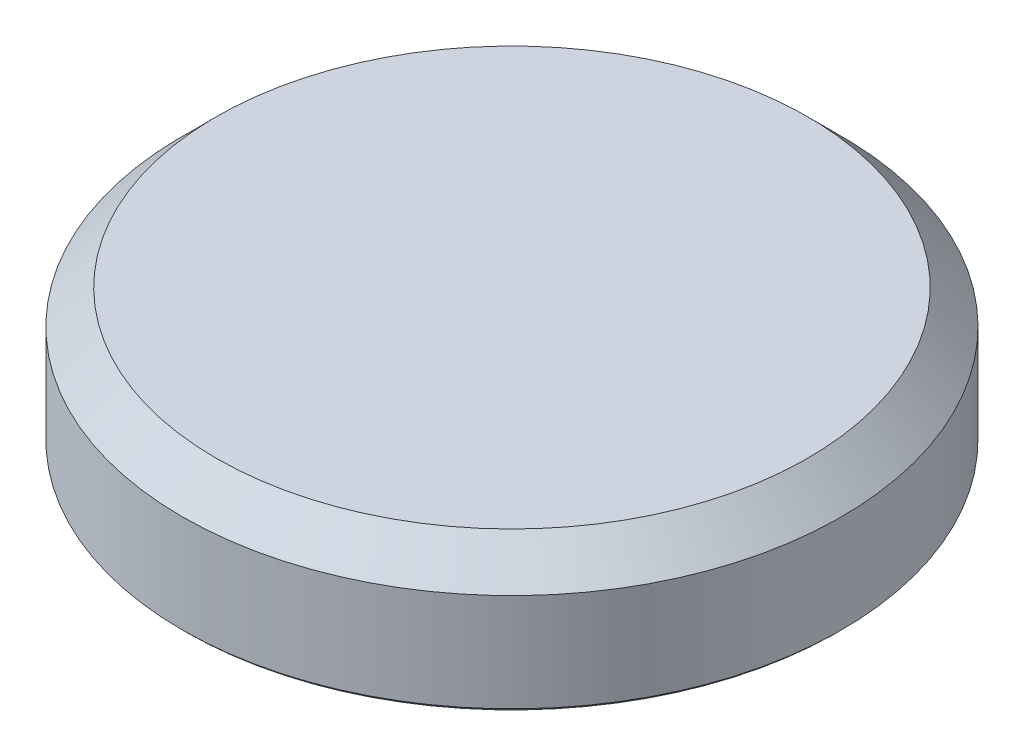
ISO-10303-21;
HEADER;
FILE_DESCRIPTION(('STEP AP214'),'2;1');
FILE_NAME('part.step','',(''),(''),'','','');
FILE_SCHEMA(('AUTOMOTIVE_DESIGN { 1 0 10303 214 1 1 1 1 }'));
ENDSEC;
DATA;
#1=APPLICATION_CONTEXT('core data for automotive mechanical design processes');
#2=APPLICATION_PROTOCOL_DEFINITION('international standard','automotive_design',2000,#1);
#3=PRODUCT_CONTEXT('',#1,'mechanical');
#4=PRODUCT('Part','Part','',(#3));
#5=PRODUCT_RELATED_PRODUCT_CATEGORY('part','',(#4));
#6=PRODUCT_DEFINITION_FORMATION('','',#4);
#7=PRODUCT_DEFINITION_CONTEXT('part definition',#1,'design');
#8=PRODUCT_DEFINITION('design','',#6,#7);
#9=PRODUCT_DEFINITION_SHAPE('','',#8);
#10=(LENGTH_UNIT() NAMED_UNIT(*) SI_UNIT(.MILLI.,.METRE.));
#11=(NAMED_UNIT(*) PLANE_ANGLE_UNIT() SI_UNIT($,.RADIAN.));
#12=(NAMED_UNIT(*) SI_UNIT($,.STERADIAN.) SOLID_ANGLE_UNIT());
#13=UNCERTAINTY_MEASURE_WITH_UNIT(LENGTH_MEASURE(1.E-05),#10,'distance_accuracy_value','');
#14=(GEOMETRIC_REPRESENTATION_CONTEXT(3) GLOBAL_UNCERTAINTY_ASSIGNED_CONTEXT((#13)) GLOBAL_UNIT_ASSIGNED_CONTEXT((#10,
#11,#12)) REPRESENTATION_CONTEXT('',''));
#15=CARTESIAN_POINT('',(0.,0.,0.));
#16=DIRECTION('',(0.,0.,1.));
#17=DIRECTION('',(1.,0.,0.));
#18=AXIS2_PLACEMENT_3D('',#15,#16,#17);
#19=CARTESIAN_POINT('',(0.,10.16,0.));
#20=DIRECTION('',(0.,-1.,0.));
#21=DIRECTION('',(0.,0.,-1.));
#22=AXIS2_PLACEMENT_3D('',#19,#20,#21);
#23=CYLINDRICAL_SURFACE('',#22,24.765);
#24=CARTESIAN_POINT('',(0.,0.254000000000004,0.));
#25=DIRECTION('',(0.,1.,0.));
#26=DIRECTION('',(0.,0.,1.));
#27=AXIS2_PLACEMENT_3D('',#24,#25,#26);
#28=CIRCLE('',#27,24.765);
#29=CARTESIAN_POINT('',(0.,0.254000000000004,24.765));
#30=VERTEX_POINT('',#29);
#31=EDGE_CURVE('E53',#30,#30,#28,.T.);
#32=ORIENTED_EDGE('',*,*,#31,.T.);
#33=EDGE_LOOP('',(#32));
#34=FACE_BOUND('',#33,.T.);
#35=CARTESIAN_POINT('',(0.,7.62,0.));
#36=DIRECTION('',(0.,1.,0.));
#37=DIRECTION('',(0.,0.,1.));
#38=AXIS2_PLACEMENT_3D('',#35,#36,#37);
#39=CIRCLE('',#38,24.765);
#40=CARTESIAN_POINT('',(0.,7.62,24.765));
#41=VERTEX_POINT('',#40);
#42=EDGE_CURVE('E111',#41,#41,#39,.F.);
#43=ORIENTED_EDGE('',*,*,#42,.T.);
#44=EDGE_LOOP('',(#43));
#45=FACE_BOUND('',#44,.T.);
#46=ADVANCED_FACE('F44',(#34,#45),#23,.T.);
#47=CARTESIAN_POINT('',(0.,10.16,0.));
#48=DIRECTION('',(0.,1.,0.));
#49=DIRECTION('',(0.,0.,1.));
#50=AXIS2_PLACEMENT_3D('',#47,#48,#49);
#51=PLANE('',#50);
#52=CARTESIAN_POINT('',(0.,10.16,0.));
#53=DIRECTION('',(0.,1.,0.));
#54=DIRECTION('',(0.,0.,1.));
#55=AXIS2_PLACEMENT_3D('',#52,#53,#54);
#56=CIRCLE('',#55,22.225);
#57=CARTESIAN_POINT('',(0.,10.16,22.225));
#58=VERTEX_POINT('',#57);
#59=EDGE_CURVE('E108',#58,#58,#56,.T.);
#60=ORIENTED_EDGE('',*,*,#59,.T.);
#61=EDGE_LOOP('',(#60));
#62=FACE_BOUND('',#61,.T.);
#63=ADVANCED_FACE('F132',(#62),#51,.T.);
#64=CARTESIAN_POINT('',(0.,0.,0.));
#65=DIRECTION('',(0.,1.,0.));
#66=DIRECTION('',(0.,0.,1.));
#67=AXIS2_PLACEMENT_3D('',#64,#65,#66);
#68=PLANE('',#67);
#69=CARTESIAN_POINT('',(0.,0.,0.));
#70=DIRECTION('',(0.,-1.,0.));
#71=DIRECTION('',(0.,0.,-1.));
#72=AXIS2_PLACEMENT_3D('',#69,#70,#71);
#73=CIRCLE('',#72,3.175);
#74=CARTESIAN_POINT('',(0.,0.,-3.175));
#75=VERTEX_POINT('',#74);
#76=EDGE_CURVE('E80',#75,#75,#73,.T.);
#77=ORIENTED_EDGE('',*,*,#76,.F.);
#78=EDGE_LOOP('',(#77));
#79=FACE_BOUND('',#78,.T.);
#80=CARTESIAN_POINT('',(4.93914086658831,0.,-4.93914086658831));
#81=DIRECTION('',(0.,-1.,0.));
#82=DIRECTION('',(0.,0.,-1.));
#83=AXIS2_PLACEMENT_3D('',#80,#81,#82);
#84=CIRCLE('',#83,3.02259999999999);
#85=CARTESIAN_POINT('',(4.93914086658831,0.,-7.9617408665883));
#86=VERTEX_POINT('',#85);
#87=EDGE_CURVE('E79',#86,#86,#84,.T.);
#88=ORIENTED_EDGE('',*,*,#87,.F.);
#89=EDGE_LOOP('',(#88));
#90=FACE_BOUND('',#89,.T.);
#91=CARTESIAN_POINT('',(-4.93914086658804,0.,-4.93914086658831));
#92=DIRECTION('',(0.,-1.,0.));
#93=DIRECTION('',(0.,0.,-1.));
#94=AXIS2_PLACEMENT_3D('',#91,#92,#93);
#95=CIRCLE('',#94,3.02259999999999);
#96=CARTESIAN_POINT('',(-4.93914086658804,0.,-7.9617408665883));
#97=VERTEX_POINT('',#96);
#98=EDGE_CURVE('E90',#97,#97,#95,.T.);
#99=ORIENTED_EDGE('',*,*,#98,.F.);
#100=EDGE_LOOP('',(#99));
#101=FACE_BOUND('',#100,.T.);
#102=CARTESIAN_POINT('',(-4.93914086658804,0.,4.93914086658804));
#103=DIRECTION('',(0.,-1.,0.));
#104=DIRECTION('',(0.,0.,-1.));
#105=AXIS2_PLACEMENT_3D('',#102,#103,#104);
#106=CIRCLE('',#105,3.02259999999999);
#107=CARTESIAN_POINT('',(-4.93914086658804,0.,1.91654086658805));
#108=VERTEX_POINT('',#107);
#109=EDGE_CURVE('E96',#108,#108,#106,.T.);
#110=ORIENTED_EDGE('',*,*,#109,.F.);
#111=EDGE_LOOP('',(#110));
#112=FACE_BOUND('',#111,.T.);
#113=CARTESIAN_POINT('',(4.93914086658831,0.,4.93914086658803));
#114=DIRECTION('',(0.,-1.,0.));
#115=DIRECTION('',(0.,0.,-1.));
#116=AXIS2_PLACEMENT_3D('',#113,#114,#115);
#117=CIRCLE('',#116,3.02259999999999);
#118=CARTESIAN_POINT('',(4.93914086658831,0.,1.91654086658804));
#119=VERTEX_POINT('',#118);
#120=EDGE_CURVE('E102',#119,#119,#117,.T.);
#121=ORIENTED_EDGE('',*,*,#120,.F.);
#122=EDGE_LOOP('',(#121));
#123=FACE_BOUND('',#122,.T.);
#124=CARTESIAN_POINT('',(0.,0.,0.));
#125=DIRECTION('',(0.,1.,0.));
#126=DIRECTION('',(0.,0.,1.));
#127=AXIS2_PLACEMENT_3D('',#124,#125,#126);
#128=CIRCLE('',#127,24.511);
#129=CARTESIAN_POINT('',(0.,0.,24.511));
#130=VERTEX_POINT('',#129);
#131=EDGE_CURVE('E11',#130,#130,#128,.F.);
#132=ORIENTED_EDGE('',*,*,#131,.T.);
#133=EDGE_LOOP('',(#132));
#134=FACE_BOUND('',#133,.T.);
#135=ADVANCED_FACE('F129',(#79,#90,#101,#112,#123,#134),#68,.F.);
#136=CARTESIAN_POINT('',(0.,10.16,0.));
#137=DIRECTION('',(0.,-1.,0.));
#138=DIRECTION('',(0.,0.,-1.));
#139=AXIS2_PLACEMENT_3D('',#136,#137,#138);
#140=CONICAL_SURFACE('',#139,22.225,0.785398163397445);
#141=ORIENTED_EDGE('',*,*,#42,.F.);
#142=EDGE_LOOP('',(#141));
#143=FACE_BOUND('',#142,.T.);
#144=ORIENTED_EDGE('',*,*,#59,.F.);
#145=EDGE_LOOP('',(#144));
#146=FACE_BOUND('',#145,.T.);
#147=ADVANCED_FACE('F120',(#143,#146),#140,.T.);
#148=CARTESIAN_POINT('',(0.,0.254000000000004,0.));
#149=DIRECTION('',(0.,1.,0.));
#150=DIRECTION('',(0.,0.,1.));
#151=AXIS2_PLACEMENT_3D('',#148,#149,#150);
#152=CONICAL_SURFACE('',#151,24.765,0.785398163397455);
#153=ORIENTED_EDGE('',*,*,#131,.F.);
#154=EDGE_LOOP('',(#153));
#155=FACE_BOUND('',#154,.T.);
#156=ORIENTED_EDGE('',*,*,#31,.F.);
#157=EDGE_LOOP('',(#156));
#158=FACE_BOUND('',#157,.T.);
#159=ADVANCED_FACE('F47',(#155,#158),#152,.T.);
#160=CARTESIAN_POINT('',(4.93914086658831,3.81,4.93914086658803));
#161=DIRECTION('',(0.,-1.,0.));
#162=DIRECTION('',(0.,0.,-1.));
#163=AXIS2_PLACEMENT_3D('',#160,#161,#162);
#164=CONICAL_SURFACE('',#163,3.0226,1.02974425867665);
#165=CARTESIAN_POINT('',(4.93914086658831,5.6261613070727,4.93914086658803));
#166=VERTEX_POINT('',#165);
#167=VERTEX_LOOP('',#166);
#168=FACE_BOUND('',#167,.T.);
#169=CARTESIAN_POINT('',(4.93914086658831,3.81,4.93914086658803));
#170=DIRECTION('',(0.,-1.,0.));
#171=DIRECTION('',(0.,0.,-1.));
#172=AXIS2_PLACEMENT_3D('',#169,#170,#171);
#173=CIRCLE('',#172,3.0226);
#174=CARTESIAN_POINT('',(4.93914086658831,3.81,1.91654086658804));
#175=VERTEX_POINT('',#174);
#176=EDGE_CURVE('E105',#175,#175,#173,.T.);
#177=ORIENTED_EDGE('',*,*,#176,.T.);
#178=EDGE_LOOP('',(#177));
#179=FACE_BOUND('',#178,.T.);
#180=ADVANCED_FACE('F119',(#168,#179),#164,.F.);
#181=CARTESIAN_POINT('',(4.93914086658831,0.,4.93914086658803));
#182=DIRECTION('',(0.,-1.,0.));
#183=DIRECTION('',(0.,0.,-1.));
#184=AXIS2_PLACEMENT_3D('',#181,#182,#183);
#185=CYLINDRICAL_SURFACE('',#184,3.02259999999999);
#186=ORIENTED_EDGE('',*,*,#176,.F.);
#187=EDGE_LOOP('',(#186));
#188=FACE_BOUND('',#187,.T.);
#189=ORIENTED_EDGE('',*,*,#120,.T.);
#190=EDGE_LOOP('',(#189));
#191=FACE_BOUND('',#190,.T.);
#192=ADVANCED_FACE('F126',(#188,#191),#185,.F.);
#193=CARTESIAN_POINT('',(-4.93914086658804,3.81,4.93914086658804));
#194=DIRECTION('',(0.,-1.,0.));
#195=DIRECTION('',(0.,0.,-1.));
#196=AXIS2_PLACEMENT_3D('',#193,#194,#195);
#197=CONICAL_SURFACE('',#196,3.0226,1.02974425867665);
#198=CARTESIAN_POINT('',(-4.93914086658804,5.6261613070727,4.93914086658804));
#199=VERTEX_POINT('',#198);
#200=VERTEX_LOOP('',#199);
#201=FACE_BOUND('',#200,.T.);
#202=CARTESIAN_POINT('',(-4.93914086658804,3.81,4.93914086658804));
#203=DIRECTION('',(0.,-1.,0.));
#204=DIRECTION('',(0.,0.,-1.));
#205=AXIS2_PLACEMENT_3D('',#202,#203,#204);
#206=CIRCLE('',#205,3.0226);
#207=CARTESIAN_POINT('',(-4.93914086658804,3.81,1.91654086658804));
#208=VERTEX_POINT('',#207);
#209=EDGE_CURVE('E99',#208,#208,#206,.T.);
#210=ORIENTED_EDGE('',*,*,#209,.T.);
#211=EDGE_LOOP('',(#210));
#212=FACE_BOUND('',#211,.T.);
#213=ADVANCED_FACE('F150',(#201,#212),#197,.F.);
#214=CARTESIAN_POINT('',(-4.93914086658804,0.,4.93914086658804));
#215=DIRECTION('',(0.,-1.,0.));
#216=DIRECTION('',(0.,0.,-1.));
#217=AXIS2_PLACEMENT_3D('',#214,#215,#216);
#218=CYLINDRICAL_SURFACE('',#217,3.02259999999999);
#219=ORIENTED_EDGE('',*,*,#209,.F.);
#220=EDGE_LOOP('',(#219));
#221=FACE_BOUND('',#220,.T.);
#222=ORIENTED_EDGE('',*,*,#109,.T.);
#223=EDGE_LOOP('',(#222));
#224=FACE_BOUND('',#223,.T.);
#225=ADVANCED_FACE('F154',(#221,#224),#218,.F.);
#226=CARTESIAN_POINT('',(-4.93914086658804,3.81,-4.93914086658831));
#227=DIRECTION('',(0.,-1.,0.));
#228=DIRECTION('',(0.,0.,-1.));
#229=AXIS2_PLACEMENT_3D('',#226,#227,#228);
#230=CONICAL_SURFACE('',#229,3.0226,1.02974425867665);
#231=CARTESIAN_POINT('',(-4.93914086658804,5.6261613070727,-4.93914086658831));
#232=VERTEX_POINT('',#231);
#233=VERTEX_LOOP('',#232);
#234=FACE_BOUND('',#233,.T.);
#235=CARTESIAN_POINT('',(-4.93914086658804,3.81,-4.93914086658831));
#236=DIRECTION('',(0.,-1.,0.));
#237=DIRECTION('',(0.,0.,-1.));
#238=AXIS2_PLACEMENT_3D('',#235,#236,#237);
#239=CIRCLE('',#238,3.0226);
#240=CARTESIAN_POINT('',(-4.93914086658804,3.81,-7.96174086658831));
#241=VERTEX_POINT('',#240);
#242=EDGE_CURVE('E93',#241,#241,#239,.T.);
#243=ORIENTED_EDGE('',*,*,#242,.T.);
#244=EDGE_LOOP('',(#243));
#245=FACE_BOUND('',#244,.T.);
#246=ADVANCED_FACE('F157',(#234,#245),#230,.F.);
#247=CARTESIAN_POINT('',(-4.93914086658804,0.,-4.93914086658831));
#248=DIRECTION('',(0.,-1.,0.));
#249=DIRECTION('',(0.,0.,-1.));
#250=AXIS2_PLACEMENT_3D('',#247,#248,#249);
#251=CYLINDRICAL_SURFACE('',#250,3.02259999999999);
#252=ORIENTED_EDGE('',*,*,#242,.F.);
#253=EDGE_LOOP('',(#252));
#254=FACE_BOUND('',#253,.T.);
#255=ORIENTED_EDGE('',*,*,#98,.T.);
#256=EDGE_LOOP('',(#255));
#257=FACE_BOUND('',#256,.T.);
#258=ADVANCED_FACE('F161',(#254,#257),#251,.F.);
#259=CARTESIAN_POINT('',(4.93914086658831,3.81,-4.93914086658831));
#260=DIRECTION('',(0.,-1.,0.));
#261=DIRECTION('',(0.,0.,-1.));
#262=AXIS2_PLACEMENT_3D('',#259,#260,#261);
#263=CONICAL_SURFACE('',#262,3.0226,1.02974425867665);
#264=CARTESIAN_POINT('',(4.93914086658831,5.6261613070727,-4.93914086658831));
#265=VERTEX_POINT('',#264);
#266=VERTEX_LOOP('',#265);
#267=FACE_BOUND('',#266,.T.);
#268=CARTESIAN_POINT('',(4.93914086658831,3.81,-4.93914086658831));
#269=DIRECTION('',(0.,-1.,0.));
#270=DIRECTION('',(0.,0.,-1.));
#271=AXIS2_PLACEMENT_3D('',#268,#269,#270);
#272=CIRCLE('',#271,3.0226);
#273=CARTESIAN_POINT('',(4.93914086658831,3.81,-7.96174086658831));
#274=VERTEX_POINT('',#273);
#275=EDGE_CURVE('E83',#274,#274,#272,.T.);
#276=ORIENTED_EDGE('',*,*,#275,.T.);
#277=EDGE_LOOP('',(#276));
#278=FACE_BOUND('',#277,.T.);
#279=ADVANCED_FACE('F165',(#267,#278),#263,.F.);
#280=CARTESIAN_POINT('',(4.93914086658831,0.,-4.93914086658831));
#281=DIRECTION('',(0.,-1.,0.));
#282=DIRECTION('',(0.,0.,-1.));
#283=AXIS2_PLACEMENT_3D('',#280,#281,#282);
#284=CYLINDRICAL_SURFACE('',#283,3.02259999999999);
#285=ORIENTED_EDGE('',*,*,#275,.F.);
#286=EDGE_LOOP('',(#285));
#287=FACE_BOUND('',#286,.T.);
#288=ORIENTED_EDGE('',*,*,#87,.T.);
#289=EDGE_LOOP('',(#288));
#290=FACE_BOUND('',#289,.T.);
#291=ADVANCED_FACE('F73',(#287,#290),#284,.F.);
#292=CARTESIAN_POINT('',(0.,7.62,0.));
#293=DIRECTION('',(0.,-1.,0.));
#294=DIRECTION('',(0.,0.,-1.));
#295=AXIS2_PLACEMENT_3D('',#292,#293,#294);
#296=CONICAL_SURFACE('',#295,3.175,1.02974425867665);
#297=CARTESIAN_POINT('',(0.,9.52773246541251,0.));
#298=VERTEX_POINT('',#297);
#299=VERTEX_LOOP('',#298);
#300=FACE_BOUND('',#299,.T.);
#301=CARTESIAN_POINT('',(0.,7.62,0.));
#302=DIRECTION('',(0.,-1.,0.));
#303=DIRECTION('',(0.,0.,-1.));
#304=AXIS2_PLACEMENT_3D('',#301,#302,#303);
#305=CIRCLE('',#304,3.175);
#306=CARTESIAN_POINT('',(0.,7.62,-3.175));
#307=VERTEX_POINT('',#306);
#308=EDGE_CURVE('E77',#307,#307,#305,.T.);
#309=ORIENTED_EDGE('',*,*,#308,.T.);
#310=EDGE_LOOP('',(#309));
#311=FACE_BOUND('',#310,.T.);
#312=ADVANCED_FACE('F69',(#300,#311),#296,.F.);
#313=CARTESIAN_POINT('',(0.,0.,0.));
#314=DIRECTION('',(0.,-1.,0.));
#315=DIRECTION('',(0.,0.,-1.));
#316=AXIS2_PLACEMENT_3D('',#313,#314,#315);
#317=CYLINDRICAL_SURFACE('',#316,3.175);
#318=ORIENTED_EDGE('',*,*,#308,.F.);
#319=EDGE_LOOP('',(#318));
#320=FACE_BOUND('',#319,.T.);
#321=ORIENTED_EDGE('',*,*,#76,.T.);
#322=EDGE_LOOP('',(#321));
#323=FACE_BOUND('',#322,.T.);
#324=ADVANCED_FACE('F72',(#320,#323),#317,.F.);
#325=CLOSED_SHELL('',(#46,#63,#135,#147,#159,#180,#192,#213,#225,#246,#258,#279,#291,#312,#324));
#326=MANIFOLD_SOLID_BREP('B2',#325);
#327=ADVANCED_BREP_SHAPE_REPRESENTATION('',(#18,#326),#14);
#328=SHAPE_DEFINITION_REPRESENTATION(#9,#327);
ENDSEC;
END-ISO-10303-21;
